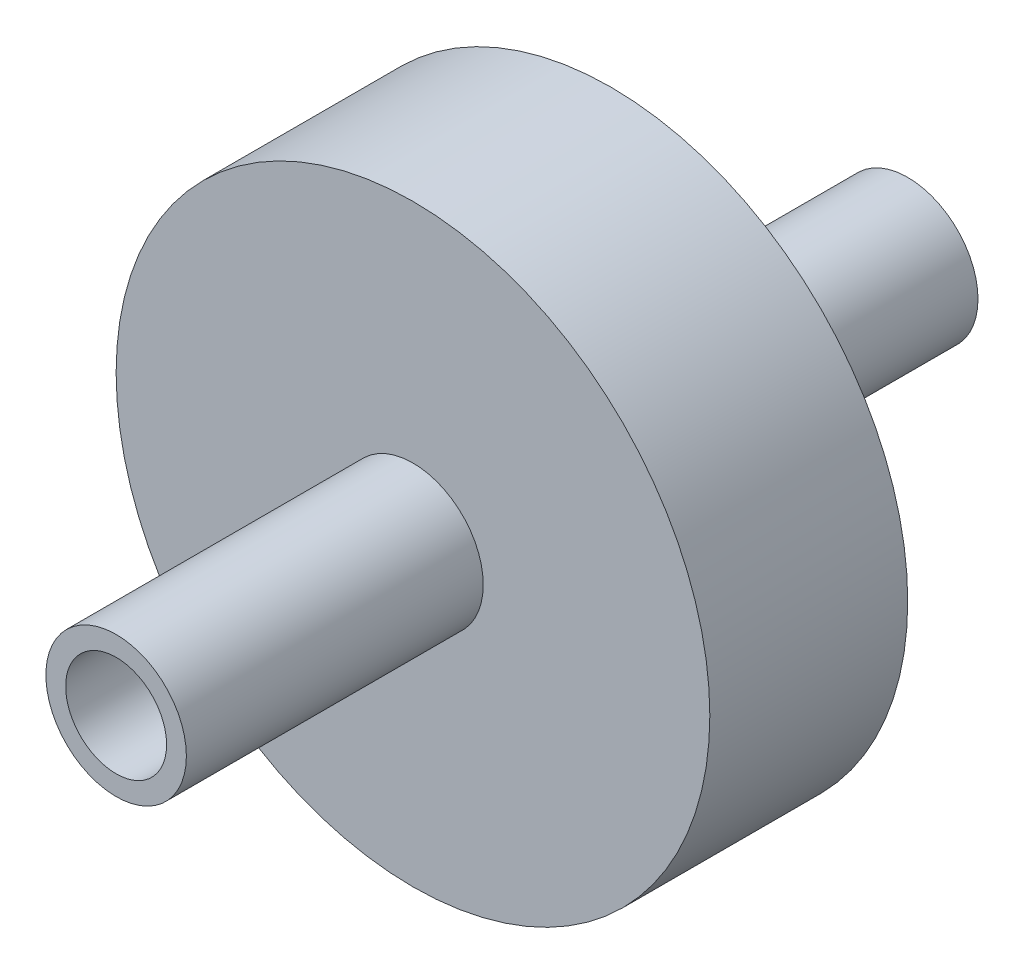
ISO-10303-21;
HEADER;
FILE_DESCRIPTION(('STEP AP214'),'2;1');
FILE_NAME('part.step','',(''),(''),'','','');
FILE_SCHEMA(('AUTOMOTIVE_DESIGN { 1 0 10303 214 1 1 1 1 }'));
ENDSEC;
DATA;
#1=APPLICATION_CONTEXT('core data for automotive mechanical design processes');
#2=APPLICATION_PROTOCOL_DEFINITION('international standard','automotive_design',2000,#1);
#3=PRODUCT_CONTEXT('',#1,'mechanical');
#4=PRODUCT('Part','Part','',(#3));
#5=PRODUCT_RELATED_PRODUCT_CATEGORY('part','',(#4));
#6=PRODUCT_DEFINITION_FORMATION('','',#4);
#7=PRODUCT_DEFINITION_CONTEXT('part definition',#1,'design');
#8=PRODUCT_DEFINITION('design','',#6,#7);
#9=PRODUCT_DEFINITION_SHAPE('','',#8);
#10=(LENGTH_UNIT() NAMED_UNIT(*) SI_UNIT(.MILLI.,.METRE.));
#11=(NAMED_UNIT(*) PLANE_ANGLE_UNIT() SI_UNIT($,.RADIAN.));
#12=(NAMED_UNIT(*) SI_UNIT($,.STERADIAN.) SOLID_ANGLE_UNIT());
#13=UNCERTAINTY_MEASURE_WITH_UNIT(LENGTH_MEASURE(1.E-05),#10,'distance_accuracy_value','');
#14=(GEOMETRIC_REPRESENTATION_CONTEXT(3) GLOBAL_UNCERTAINTY_ASSIGNED_CONTEXT((#13)) GLOBAL_UNIT_ASSIGNED_CONTEXT((#10,
#11,#12)) REPRESENTATION_CONTEXT('',''));
#15=CARTESIAN_POINT('',(0.,0.,0.));
#16=DIRECTION('',(0.,0.,1.));
#17=DIRECTION('',(1.,0.,0.));
#18=AXIS2_PLACEMENT_3D('',#15,#16,#17);
#19=CARTESIAN_POINT('',(0.,0.,10.));
#20=DIRECTION('',(0.,0.,-1.));
#21=DIRECTION('',(-1.,0.,0.));
#22=AXIS2_PLACEMENT_3D('',#19,#20,#21);
#23=CYLINDRICAL_SURFACE('',#22,15.);
#24=CARTESIAN_POINT('',(0.,0.,10.));
#25=DIRECTION('',(0.,0.,1.));
#26=DIRECTION('',(1.,0.,0.));
#27=AXIS2_PLACEMENT_3D('',#24,#25,#26);
#28=CIRCLE('',#27,15.);
#29=CARTESIAN_POINT('',(15.,0.,10.));
#30=VERTEX_POINT('',#29);
#31=EDGE_CURVE('E40',#30,#30,#28,.T.);
#32=ORIENTED_EDGE('',*,*,#31,.F.);
#33=EDGE_LOOP('',(#32));
#34=FACE_BOUND('',#33,.T.);
#35=CARTESIAN_POINT('',(0.,0.,0.));
#36=DIRECTION('',(0.,0.,1.));
#37=DIRECTION('',(1.,0.,0.));
#38=AXIS2_PLACEMENT_3D('',#35,#36,#37);
#39=CIRCLE('',#38,15.);
#40=CARTESIAN_POINT('',(15.,0.,0.));
#41=VERTEX_POINT('',#40);
#42=EDGE_CURVE('E45',#41,#41,#39,.T.);
#43=ORIENTED_EDGE('',*,*,#42,.T.);
#44=EDGE_LOOP('',(#43));
#45=FACE_BOUND('',#44,.T.);
#46=ADVANCED_FACE('F33',(#34,#45),#23,.T.);
#47=CARTESIAN_POINT('',(0.,0.,10.));
#48=DIRECTION('',(0.,0.,1.));
#49=DIRECTION('',(1.,0.,0.));
#50=AXIS2_PLACEMENT_3D('',#47,#48,#49);
#51=PLANE('',#50);
#52=CARTESIAN_POINT('',(0.,0.,10.));
#53=DIRECTION('',(0.,0.,1.));
#54=DIRECTION('',(1.,0.,0.));
#55=AXIS2_PLACEMENT_3D('',#52,#53,#54);
#56=CIRCLE('',#55,3.55);
#57=CARTESIAN_POINT('',(3.55,0.,10.));
#58=VERTEX_POINT('',#57);
#59=EDGE_CURVE('E10',#58,#58,#56,.T.);
#60=ORIENTED_EDGE('',*,*,#59,.F.);
#61=EDGE_LOOP('',(#60));
#62=FACE_BOUND('',#61,.T.);
#63=ORIENTED_EDGE('',*,*,#31,.T.);
#64=EDGE_LOOP('',(#63));
#65=FACE_BOUND('',#64,.T.);
#66=ADVANCED_FACE('F85',(#62,#65),#51,.T.);
#67=CARTESIAN_POINT('',(0.,0.,0.));
#68=DIRECTION('',(0.,0.,1.));
#69=DIRECTION('',(1.,0.,0.));
#70=AXIS2_PLACEMENT_3D('',#67,#68,#69);
#71=PLANE('',#70);
#72=CARTESIAN_POINT('',(0.,0.,0.));
#73=DIRECTION('',(0.,0.,1.));
#74=DIRECTION('',(1.,0.,0.));
#75=AXIS2_PLACEMENT_3D('',#72,#73,#74);
#76=CIRCLE('',#75,3.55);
#77=CARTESIAN_POINT('',(3.55,0.,0.));
#78=VERTEX_POINT('',#77);
#79=EDGE_CURVE('E36',#78,#78,#76,.T.);
#80=ORIENTED_EDGE('',*,*,#79,.T.);
#81=EDGE_LOOP('',(#80));
#82=FACE_BOUND('',#81,.T.);
#83=ORIENTED_EDGE('',*,*,#42,.F.);
#84=EDGE_LOOP('',(#83));
#85=FACE_BOUND('',#84,.T.);
#86=ADVANCED_FACE('F90',(#82,#85),#71,.F.);
#87=CARTESIAN_POINT('',(0.,0.,-15.));
#88=DIRECTION('',(0.,0.,1.));
#89=DIRECTION('',(1.,0.,0.));
#90=AXIS2_PLACEMENT_3D('',#87,#88,#89);
#91=CYLINDRICAL_SURFACE('',#90,3.55);
#92=CARTESIAN_POINT('',(0.,0.,-15.));
#93=DIRECTION('',(0.,0.,1.));
#94=DIRECTION('',(1.,0.,0.));
#95=AXIS2_PLACEMENT_3D('',#92,#93,#94);
#96=CIRCLE('',#95,3.55);
#97=CARTESIAN_POINT('',(3.55,0.,-15.));
#98=VERTEX_POINT('',#97);
#99=EDGE_CURVE('E48',#98,#98,#96,.T.);
#100=ORIENTED_EDGE('',*,*,#99,.T.);
#101=EDGE_LOOP('',(#100));
#102=FACE_BOUND('',#101,.T.);
#103=ORIENTED_EDGE('',*,*,#79,.F.);
#104=EDGE_LOOP('',(#103));
#105=FACE_BOUND('',#104,.T.);
#106=ADVANCED_FACE('F82',(#102,#105),#91,.T.);
#107=CARTESIAN_POINT('',(0.,0.,-15.));
#108=DIRECTION('',(0.,0.,1.));
#109=DIRECTION('',(1.,0.,0.));
#110=AXIS2_PLACEMENT_3D('',#107,#108,#109);
#111=PLANE('',#110);
#112=CARTESIAN_POINT('',(0.,0.,-15.));
#113=DIRECTION('',(0.,0.,1.));
#114=DIRECTION('',(1.,0.,0.));
#115=AXIS2_PLACEMENT_3D('',#112,#113,#114);
#116=CIRCLE('',#115,2.55);
#117=CARTESIAN_POINT('',(2.55,0.,-15.));
#118=VERTEX_POINT('',#117);
#119=EDGE_CURVE('E57',#118,#118,#116,.T.);
#120=ORIENTED_EDGE('',*,*,#119,.T.);
#121=EDGE_LOOP('',(#120));
#122=FACE_BOUND('',#121,.T.);
#123=ORIENTED_EDGE('',*,*,#99,.F.);
#124=EDGE_LOOP('',(#123));
#125=FACE_BOUND('',#124,.T.);
#126=ADVANCED_FACE('F99',(#122,#125),#111,.F.);
#127=CARTESIAN_POINT('',(0.,0.,-15.));
#128=DIRECTION('',(0.,0.,1.));
#129=DIRECTION('',(1.,0.,0.));
#130=AXIS2_PLACEMENT_3D('',#127,#128,#129);
#131=CYLINDRICAL_SURFACE('',#130,2.55);
#132=ORIENTED_EDGE('',*,*,#119,.F.);
#133=EDGE_LOOP('',(#132));
#134=FACE_BOUND('',#133,.T.);
#135=CARTESIAN_POINT('',(0.,0.,25.));
#136=DIRECTION('',(0.,0.,1.));
#137=DIRECTION('',(1.,0.,0.));
#138=AXIS2_PLACEMENT_3D('',#135,#136,#137);
#139=CIRCLE('',#138,2.55);
#140=CARTESIAN_POINT('',(2.55,0.,25.));
#141=VERTEX_POINT('',#140);
#142=EDGE_CURVE('E65',#141,#141,#139,.T.);
#143=ORIENTED_EDGE('',*,*,#142,.T.);
#144=EDGE_LOOP('',(#143));
#145=FACE_BOUND('',#144,.T.);
#146=ADVANCED_FACE('F71',(#134,#145),#131,.F.);
#147=ORIENTED_EDGE('',*,*,#59,.T.);
#148=EDGE_LOOP('',(#147));
#149=FACE_BOUND('',#148,.T.);
#150=CARTESIAN_POINT('',(0.,0.,25.));
#151=DIRECTION('',(0.,0.,1.));
#152=DIRECTION('',(1.,0.,0.));
#153=AXIS2_PLACEMENT_3D('',#150,#151,#152);
#154=CIRCLE('',#153,3.55);
#155=CARTESIAN_POINT('',(3.55,0.,25.));
#156=VERTEX_POINT('',#155);
#157=EDGE_CURVE('E61',#156,#156,#154,.T.);
#158=ORIENTED_EDGE('',*,*,#157,.F.);
#159=EDGE_LOOP('',(#158));
#160=FACE_BOUND('',#159,.T.);
#161=ADVANCED_FACE('F75',(#149,#160),#91,.T.);
#162=CARTESIAN_POINT('',(0.,0.,25.));
#163=DIRECTION('',(0.,0.,1.));
#164=DIRECTION('',(1.,0.,0.));
#165=AXIS2_PLACEMENT_3D('',#162,#163,#164);
#166=PLANE('',#165);
#167=ORIENTED_EDGE('',*,*,#157,.T.);
#168=EDGE_LOOP('',(#167));
#169=FACE_BOUND('',#168,.T.);
#170=ORIENTED_EDGE('',*,*,#142,.F.);
#171=EDGE_LOOP('',(#170));
#172=FACE_BOUND('',#171,.T.);
#173=ADVANCED_FACE('F73',(#169,#172),#166,.T.);
#174=CLOSED_SHELL('',(#46,#66,#86,#106,#126,#146,#161,#173));
#175=MANIFOLD_SOLID_BREP('B2',#174);
#176=ADVANCED_BREP_SHAPE_REPRESENTATION('',(#18,#175),#14);
#177=SHAPE_DEFINITION_REPRESENTATION(#9,#176);
ENDSEC;
END-ISO-10303-21;
